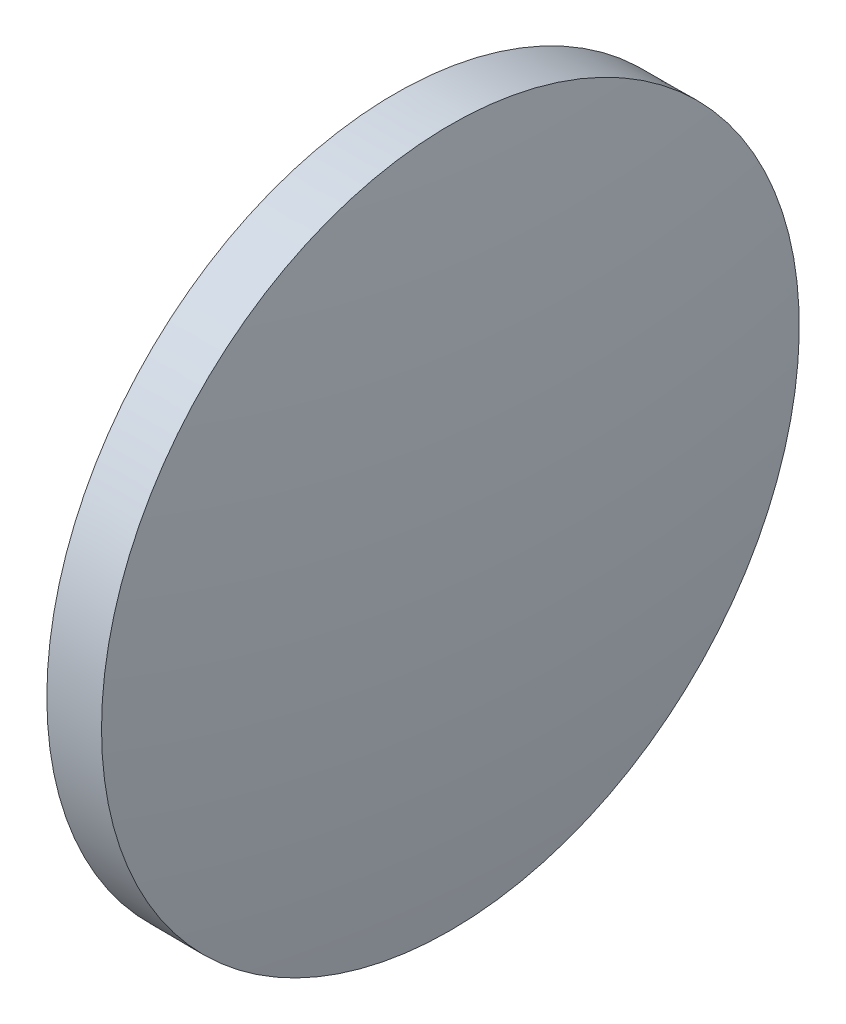
ISO-10303-21;
HEADER;
FILE_DESCRIPTION(('STEP AP214'),'2;1');
FILE_NAME('part.step','',(''),(''),'','','');
FILE_SCHEMA(('AUTOMOTIVE_DESIGN { 1 0 10303 214 1 1 1 1 }'));
ENDSEC;
DATA;
#1=APPLICATION_CONTEXT('core data for automotive mechanical design processes');
#2=APPLICATION_PROTOCOL_DEFINITION('international standard','automotive_design',2000,#1);
#3=PRODUCT_CONTEXT('',#1,'mechanical');
#4=PRODUCT('Part','Part','',(#3));
#5=PRODUCT_RELATED_PRODUCT_CATEGORY('part','',(#4));
#6=PRODUCT_DEFINITION_FORMATION('','',#4);
#7=PRODUCT_DEFINITION_CONTEXT('part definition',#1,'design');
#8=PRODUCT_DEFINITION('design','',#6,#7);
#9=PRODUCT_DEFINITION_SHAPE('','',#8);
#10=(LENGTH_UNIT() NAMED_UNIT(*) SI_UNIT(.MILLI.,.METRE.));
#11=(NAMED_UNIT(*) PLANE_ANGLE_UNIT() SI_UNIT($,.RADIAN.));
#12=(NAMED_UNIT(*) SI_UNIT($,.STERADIAN.) SOLID_ANGLE_UNIT());
#13=UNCERTAINTY_MEASURE_WITH_UNIT(LENGTH_MEASURE(1.E-05),#10,'distance_accuracy_value','');
#14=(GEOMETRIC_REPRESENTATION_CONTEXT(3) GLOBAL_UNCERTAINTY_ASSIGNED_CONTEXT((#13)) GLOBAL_UNIT_ASSIGNED_CONTEXT((#10,
#11,#12)) REPRESENTATION_CONTEXT('',''));
#15=CARTESIAN_POINT('',(0.,0.,0.));
#16=DIRECTION('',(0.,0.,1.));
#17=DIRECTION('',(1.,0.,0.));
#18=AXIS2_PLACEMENT_3D('',#15,#16,#17);
#19=CARTESIAN_POINT('',(169.90045580077,48.6320921391735,-0.00423213610773604));
#20=DIRECTION('',(0.,-1.,0.));
#21=DIRECTION('',(0.,0.,1.));
#22=AXIS2_PLACEMENT_3D('',#19,#20,#21);
#23=CIRCLE('',#22,85.363843378245);
#24=TRIMMED_CURVE('',#23,(PARAMETER_VALUE(-1.57074674917583)),
(PARAMETER_VALUE(1.57074674917583)),.T.,.PARAMETER.);
#25=CARTESIAN_POINT('',(169.90045580077,48.6320921391735,0.));
#26=DIRECTION('',(-1.,0.,0.));
#27=AXIS1_PLACEMENT('',#25,#26);
#28=SURFACE_OF_REVOLUTION('',#24,#27);
#29=CARTESIAN_POINT('',(84.5366125274341,48.6320921391735,0.));
#30=VERTEX_POINT('',#29);
#31=VERTEX_LOOP('',#30);
#32=FACE_BOUND('',#31,.T.);
#33=CARTESIAN_POINT('',(85.4866282281878,48.6320921391735,0.));
#34=DIRECTION('',(-1.,0.,0.));
#35=DIRECTION('',(0.,0.,1.));
#36=AXIS2_PLACEMENT_3D('',#33,#34,#35);
#37=CIRCLE('',#36,12.6958257713188);
#38=CARTESIAN_POINT('',(85.4866282281878,48.6320921391735,12.6958257713188));
#39=VERTEX_POINT('',#38);
#40=EDGE_CURVE('E48',#39,#39,#37,.T.);
#41=ORIENTED_EDGE('',*,*,#40,.T.);
#42=EDGE_LOOP('',(#41));
#43=FACE_BOUND('',#42,.T.);
#44=ADVANCED_FACE('F41',(#32,#43),#28,.T.);
#45=CARTESIAN_POINT('',(3.07340263439456,48.6320921391735,0.));
#46=DIRECTION('',(-1.,0.,0.));
#47=DIRECTION('',(0.,-1.,0.));
#48=AXIS2_PLACEMENT_3D('',#45,#46,#47);
#49=SPHERICAL_SURFACE('',#48,85.3638433782438);
#50=CARTESIAN_POINT('',(87.4866108039269,48.6320921391735,0.));
#51=DIRECTION('',(-1.,0.,0.));
#52=DIRECTION('',(0.,0.,1.));
#53=AXIS2_PLACEMENT_3D('',#50,#51,#52);
#54=CIRCLE('',#53,12.7041742286752);
#55=CARTESIAN_POINT('',(87.4866108039269,48.6320921391735,12.7041742286752));
#56=VERTEX_POINT('',#55);
#57=EDGE_CURVE('E11',#56,#56,#54,.T.);
#58=ORIENTED_EDGE('',*,*,#57,.F.);
#59=EDGE_LOOP('',(#58));
#60=FACE_BOUND('',#59,.T.);
#61=ADVANCED_FACE('F53',(#60),#49,.T.);
#62=CARTESIAN_POINT('',(85.4866282281878,48.6320921391735,0.));
#63=DIRECTION('',(1.,0.,0.));
#64=DIRECTION('',(0.,0.,-1.));
#65=AXIS2_PLACEMENT_3D('',#62,#63,#64);
#66=CONICAL_SURFACE('',#65,12.6958257713188,0.00417424080033928);
#67=ORIENTED_EDGE('',*,*,#57,.T.);
#68=EDGE_LOOP('',(#67));
#69=FACE_BOUND('',#68,.T.);
#70=ORIENTED_EDGE('',*,*,#40,.F.);
#71=EDGE_LOOP('',(#70));
#72=FACE_BOUND('',#71,.T.);
#73=ADVANCED_FACE('F58',(#69,#72),#66,.T.);
#74=CLOSED_SHELL('',(#44,#61,#73));
#75=MANIFOLD_SOLID_BREP('B2',#74);
#76=ADVANCED_BREP_SHAPE_REPRESENTATION('',(#18,#75),#14);
#77=SHAPE_DEFINITION_REPRESENTATION(#9,#76);
ENDSEC;
END-ISO-10303-21;
